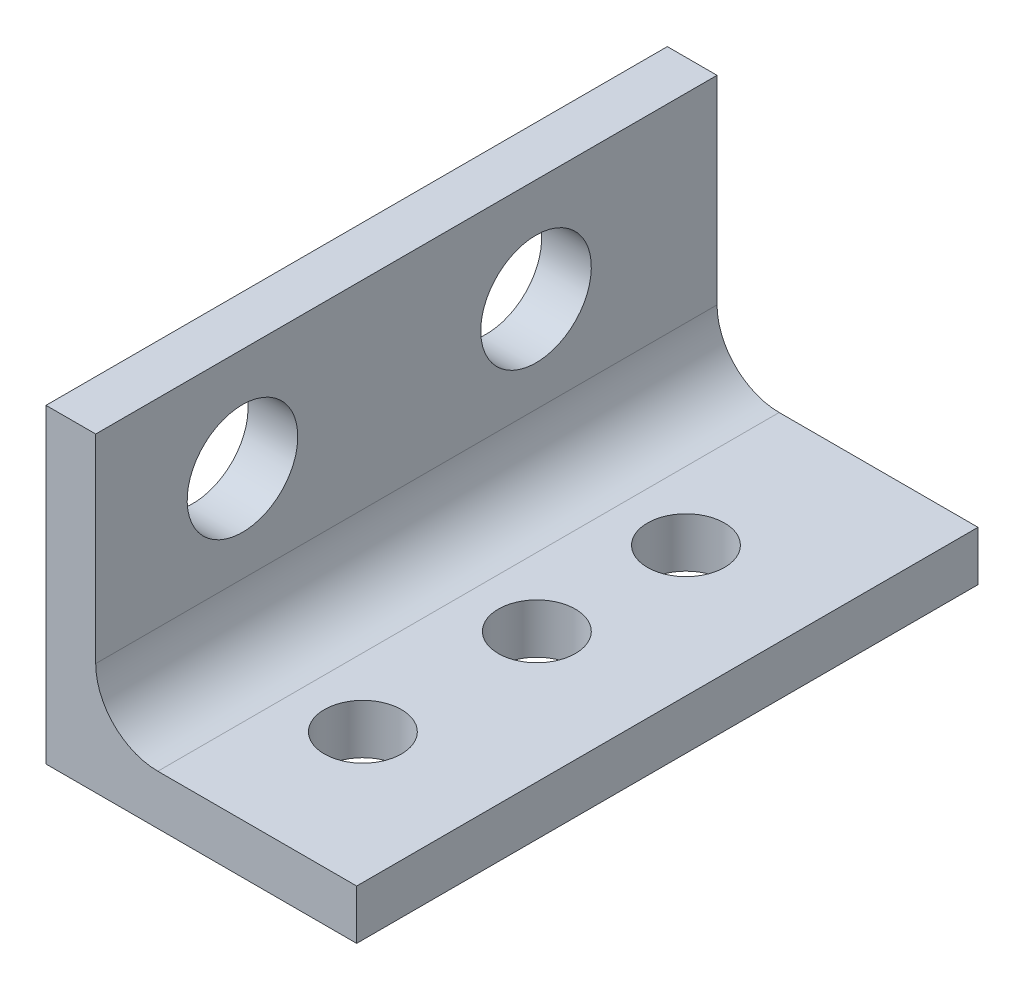
ISO-10303-21;
HEADER;
FILE_DESCRIPTION(('STEP AP214'),'2;1');
FILE_NAME('part.step','',(''),(''),'','','');
FILE_SCHEMA(('AUTOMOTIVE_DESIGN { 1 0 10303 214 1 1 1 1 }'));
ENDSEC;
DATA;
#1=APPLICATION_CONTEXT('core data for automotive mechanical design processes');
#2=APPLICATION_PROTOCOL_DEFINITION('international standard','automotive_design',2000,#1);
#3=PRODUCT_CONTEXT('',#1,'mechanical');
#4=PRODUCT('Part','Part','',(#3));
#5=PRODUCT_RELATED_PRODUCT_CATEGORY('part','',(#4));
#6=PRODUCT_DEFINITION_FORMATION('','',#4);
#7=PRODUCT_DEFINITION_CONTEXT('part definition',#1,'design');
#8=PRODUCT_DEFINITION('design','',#6,#7);
#9=PRODUCT_DEFINITION_SHAPE('','',#8);
#10=(LENGTH_UNIT() NAMED_UNIT(*) SI_UNIT(.MILLI.,.METRE.));
#11=(NAMED_UNIT(*) PLANE_ANGLE_UNIT() SI_UNIT($,.RADIAN.));
#12=(NAMED_UNIT(*) SI_UNIT($,.STERADIAN.) SOLID_ANGLE_UNIT());
#13=UNCERTAINTY_MEASURE_WITH_UNIT(LENGTH_MEASURE(1.E-05),#10,'distance_accuracy_value','');
#14=(GEOMETRIC_REPRESENTATION_CONTEXT(3) GLOBAL_UNCERTAINTY_ASSIGNED_CONTEXT((#13)) GLOBAL_UNIT_ASSIGNED_CONTEXT((#10,
#11,#12)) REPRESENTATION_CONTEXT('',''));
#15=CARTESIAN_POINT('',(0.,0.,0.));
#16=DIRECTION('',(0.,0.,1.));
#17=DIRECTION('',(1.,0.,0.));
#18=AXIS2_PLACEMENT_3D('',#15,#16,#17);
#19=CARTESIAN_POINT('',(-5.334,6.35,12.7));
#20=DIRECTION('',(0.,-1.,0.));
#21=DIRECTION('',(0.,0.,-1.));
#22=AXIS2_PLACEMENT_3D('',#19,#20,#21);
#23=PLANE('',#22);
#24=DIRECTION('',(-1.,0.,0.));
#25=VECTOR('',#24,1.);
#26=CARTESIAN_POINT('',(-5.334,6.35,0.));
#27=LINE('',#26,#25);
#28=CARTESIAN_POINT('',(-5.334,6.35,0.));
#29=VERTEX_POINT('',#28);
#30=CARTESIAN_POINT('',(-6.35,6.35,0.));
#31=VERTEX_POINT('',#30);
#32=EDGE_CURVE('E132',#29,#31,#27,.T.);
#33=ORIENTED_EDGE('',*,*,#32,.T.);
#34=DIRECTION('',(0.,0.,-1.));
#35=VECTOR('',#34,1.);
#36=CARTESIAN_POINT('',(-6.35,6.35,12.7));
#37=LINE('',#36,#35);
#38=CARTESIAN_POINT('',(-6.35,6.35,12.7));
#39=VERTEX_POINT('',#38);
#40=EDGE_CURVE('E113',#39,#31,#37,.T.);
#41=ORIENTED_EDGE('',*,*,#40,.F.);
#42=DIRECTION('',(-1.,0.,0.));
#43=VECTOR('',#42,1.);
#44=CARTESIAN_POINT('',(-5.334,6.35,12.7));
#45=LINE('',#44,#43);
#46=CARTESIAN_POINT('',(-5.334,6.35,12.7));
#47=VERTEX_POINT('',#46);
#48=EDGE_CURVE('E120',#47,#39,#45,.T.);
#49=ORIENTED_EDGE('',*,*,#48,.F.);
#50=DIRECTION('',(0.,0.,-1.));
#51=VECTOR('',#50,1.);
#52=CARTESIAN_POINT('',(-5.334,6.35,12.7));
#53=LINE('',#52,#51);
#54=EDGE_CURVE('E163',#47,#29,#53,.T.);
#55=ORIENTED_EDGE('',*,*,#54,.T.);
#56=EDGE_LOOP('',(#33,#41,#49,#55));
#57=FACE_BOUND('',#56,.T.);
#58=ADVANCED_FACE('F43',(#57),#23,.F.);
#59=CARTESIAN_POINT('',(-6.35,6.35,12.7));
#60=DIRECTION('',(1.,0.,0.));
#61=DIRECTION('',(0.,1.,0.));
#62=AXIS2_PLACEMENT_3D('',#59,#60,#61);
#63=PLANE('',#62);
#64=CARTESIAN_POINT('',(-6.35,4.24,3.7));
#65=DIRECTION('',(1.,0.,0.));
#66=DIRECTION('',(0.,1.,0.));
#67=AXIS2_PLACEMENT_3D('',#64,#65,#66);
#68=CIRCLE('',#67,1.1303);
#69=CARTESIAN_POINT('',(-6.35,5.3703,3.7));
#70=VERTEX_POINT('',#69);
#71=EDGE_CURVE('E208',#70,#70,#68,.F.);
#72=ORIENTED_EDGE('',*,*,#71,.F.);
#73=EDGE_LOOP('',(#72));
#74=FACE_BOUND('',#73,.T.);
#75=CARTESIAN_POINT('',(-6.35,4.24,9.7));
#76=DIRECTION('',(1.,0.,0.));
#77=DIRECTION('',(0.,1.,0.));
#78=AXIS2_PLACEMENT_3D('',#75,#76,#77);
#79=CIRCLE('',#78,1.1303);
#80=CARTESIAN_POINT('',(-6.35,5.3703,9.7));
#81=VERTEX_POINT('',#80);
#82=EDGE_CURVE('E202',#81,#81,#79,.F.);
#83=ORIENTED_EDGE('',*,*,#82,.F.);
#84=EDGE_LOOP('',(#83));
#85=FACE_BOUND('',#84,.T.);
#86=DIRECTION('',(0.,-1.,0.));
#87=VECTOR('',#86,1.);
#88=CARTESIAN_POINT('',(-6.35,6.35,0.));
#89=LINE('',#88,#87);
#90=CARTESIAN_POINT('',(-6.35,0.,0.));
#91=VERTEX_POINT('',#90);
#92=EDGE_CURVE('E151',#31,#91,#89,.T.);
#93=ORIENTED_EDGE('',*,*,#92,.T.);
#94=DIRECTION('',(0.,0.,-1.));
#95=VECTOR('',#94,1.);
#96=CARTESIAN_POINT('',(-6.35,0.,12.7));
#97=LINE('',#96,#95);
#98=CARTESIAN_POINT('',(-6.35,0.,12.7));
#99=VERTEX_POINT('',#98);
#100=EDGE_CURVE('E116',#99,#91,#97,.T.);
#101=ORIENTED_EDGE('',*,*,#100,.F.);
#102=DIRECTION('',(0.,-1.,0.));
#103=VECTOR('',#102,1.);
#104=CARTESIAN_POINT('',(-6.35,6.35,12.7));
#105=LINE('',#104,#103);
#106=EDGE_CURVE('E109',#39,#99,#105,.T.);
#107=ORIENTED_EDGE('',*,*,#106,.F.);
#108=ORIENTED_EDGE('',*,*,#40,.T.);
#109=EDGE_LOOP('',(#93,#101,#107,#108));
#110=FACE_BOUND('',#109,.T.);
#111=ADVANCED_FACE('F111',(#74,#85,#110),#63,.F.);
#112=CARTESIAN_POINT('',(-6.35,0.,12.7));
#113=DIRECTION('',(0.,1.,0.));
#114=DIRECTION('',(0.,0.,1.));
#115=AXIS2_PLACEMENT_3D('',#112,#113,#114);
#116=PLANE('',#115);
#117=CARTESIAN_POINT('',(-2.667,0.,3.302));
#118=DIRECTION('',(0.,1.,0.));
#119=DIRECTION('',(0.,0.,1.));
#120=AXIS2_PLACEMENT_3D('',#117,#118,#119);
#121=CIRCLE('',#120,0.787400000000001);
#122=CARTESIAN_POINT('',(-2.667,0.,4.0894));
#123=VERTEX_POINT('',#122);
#124=EDGE_CURVE('E194',#123,#123,#121,.T.);
#125=ORIENTED_EDGE('',*,*,#124,.T.);
#126=EDGE_LOOP('',(#125));
#127=FACE_BOUND('',#126,.T.);
#128=CARTESIAN_POINT('',(-2.667,0.,6.35));
#129=DIRECTION('',(0.,1.,0.));
#130=DIRECTION('',(0.,0.,1.));
#131=AXIS2_PLACEMENT_3D('',#128,#129,#130);
#132=CIRCLE('',#131,0.7874);
#133=CARTESIAN_POINT('',(-2.667,0.,7.1374));
#134=VERTEX_POINT('',#133);
#135=EDGE_CURVE('E186',#134,#134,#132,.T.);
#136=ORIENTED_EDGE('',*,*,#135,.T.);
#137=EDGE_LOOP('',(#136));
#138=FACE_BOUND('',#137,.T.);
#139=CARTESIAN_POINT('',(-2.667,0.,9.906));
#140=DIRECTION('',(0.,1.,0.));
#141=DIRECTION('',(0.,0.,1.));
#142=AXIS2_PLACEMENT_3D('',#139,#140,#141);
#143=CIRCLE('',#142,0.7874);
#144=CARTESIAN_POINT('',(-2.667,0.,10.6934));
#145=VERTEX_POINT('',#144);
#146=EDGE_CURVE('E161',#145,#145,#143,.T.);
#147=ORIENTED_EDGE('',*,*,#146,.T.);
#148=EDGE_LOOP('',(#147));
#149=FACE_BOUND('',#148,.T.);
#150=DIRECTION('',(1.,0.,0.));
#151=VECTOR('',#150,1.);
#152=CARTESIAN_POINT('',(-6.35,0.,0.));
#153=LINE('',#152,#151);
#154=CARTESIAN_POINT('',(0.,0.,0.));
#155=VERTEX_POINT('',#154);
#156=EDGE_CURVE('E153',#91,#155,#153,.T.);
#157=ORIENTED_EDGE('',*,*,#156,.T.);
#158=DIRECTION('',(0.,0.,-1.));
#159=VECTOR('',#158,1.);
#160=CARTESIAN_POINT('',(0.,0.,12.7));
#161=LINE('',#160,#159);
#162=CARTESIAN_POINT('',(0.,0.,12.7));
#163=VERTEX_POINT('',#162);
#164=EDGE_CURVE('E142',#163,#155,#161,.T.);
#165=ORIENTED_EDGE('',*,*,#164,.F.);
#166=DIRECTION('',(1.,0.,0.));
#167=VECTOR('',#166,1.);
#168=CARTESIAN_POINT('',(-6.35,0.,12.7));
#169=LINE('',#168,#167);
#170=EDGE_CURVE('E119',#99,#163,#169,.T.);
#171=ORIENTED_EDGE('',*,*,#170,.F.);
#172=ORIENTED_EDGE('',*,*,#100,.T.);
#173=EDGE_LOOP('',(#157,#165,#171,#172));
#174=FACE_BOUND('',#173,.T.);
#175=ADVANCED_FACE('F239',(#127,#138,#149,#174),#116,.F.);
#176=CARTESIAN_POINT('',(0.,1.016,12.7));
#177=DIRECTION('',(-1.,0.,0.));
#178=DIRECTION('',(0.,0.,1.));
#179=AXIS2_PLACEMENT_3D('',#176,#177,#178);
#180=PLANE('',#179);
#181=DIRECTION('',(0.,1.,0.));
#182=VECTOR('',#181,1.);
#183=CARTESIAN_POINT('',(0.,1.016,0.));
#184=LINE('',#183,#182);
#185=CARTESIAN_POINT('',(0.,1.016,0.));
#186=VERTEX_POINT('',#185);
#187=EDGE_CURVE('E156',#155,#186,#184,.T.);
#188=ORIENTED_EDGE('',*,*,#187,.T.);
#189=DIRECTION('',(0.,0.,-1.));
#190=VECTOR('',#189,1.);
#191=CARTESIAN_POINT('',(0.,1.016,12.7));
#192=LINE('',#191,#190);
#193=CARTESIAN_POINT('',(0.,1.016,12.7));
#194=VERTEX_POINT('',#193);
#195=EDGE_CURVE('E160',#194,#186,#192,.T.);
#196=ORIENTED_EDGE('',*,*,#195,.F.);
#197=DIRECTION('',(0.,1.,0.));
#198=VECTOR('',#197,1.);
#199=CARTESIAN_POINT('',(0.,1.016,12.7));
#200=LINE('',#199,#198);
#201=EDGE_CURVE('E177',#163,#194,#200,.T.);
#202=ORIENTED_EDGE('',*,*,#201,.F.);
#203=ORIENTED_EDGE('',*,*,#164,.T.);
#204=EDGE_LOOP('',(#188,#196,#202,#203));
#205=FACE_BOUND('',#204,.T.);
#206=ADVANCED_FACE('F236',(#205),#180,.F.);
#207=CARTESIAN_POINT('',(-5.334,1.016,12.7));
#208=DIRECTION('',(0.,-1.,0.));
#209=DIRECTION('',(0.,0.,-1.));
#210=AXIS2_PLACEMENT_3D('',#207,#208,#209);
#211=PLANE('',#210);
#212=CARTESIAN_POINT('',(-2.667,1.016,3.302));
#213=DIRECTION('',(0.,1.,0.));
#214=DIRECTION('',(0.,0.,1.));
#215=AXIS2_PLACEMENT_3D('',#212,#213,#214);
#216=CIRCLE('',#215,0.787400000000001);
#217=CARTESIAN_POINT('',(-2.667,1.016,4.0894));
#218=VERTEX_POINT('',#217);
#219=EDGE_CURVE('E198',#218,#218,#216,.T.);
#220=ORIENTED_EDGE('',*,*,#219,.F.);
#221=EDGE_LOOP('',(#220));
#222=FACE_BOUND('',#221,.T.);
#223=CARTESIAN_POINT('',(-2.667,1.016,6.35));
#224=DIRECTION('',(0.,1.,0.));
#225=DIRECTION('',(0.,0.,1.));
#226=AXIS2_PLACEMENT_3D('',#223,#224,#225);
#227=CIRCLE('',#226,0.7874);
#228=CARTESIAN_POINT('',(-2.667,1.016,7.1374));
#229=VERTEX_POINT('',#228);
#230=EDGE_CURVE('E190',#229,#229,#227,.T.);
#231=ORIENTED_EDGE('',*,*,#230,.F.);
#232=EDGE_LOOP('',(#231));
#233=FACE_BOUND('',#232,.T.);
#234=CARTESIAN_POINT('',(-2.667,1.016,9.906));
#235=DIRECTION('',(0.,1.,0.));
#236=DIRECTION('',(0.,0.,1.));
#237=AXIS2_PLACEMENT_3D('',#234,#235,#236);
#238=CIRCLE('',#237,0.7874);
#239=CARTESIAN_POINT('',(-2.667,1.016,10.6934));
#240=VERTEX_POINT('',#239);
#241=EDGE_CURVE('E183',#240,#240,#238,.T.);
#242=ORIENTED_EDGE('',*,*,#241,.F.);
#243=EDGE_LOOP('',(#242));
#244=FACE_BOUND('',#243,.T.);
#245=DIRECTION('',(-1.,0.,0.));
#246=VECTOR('',#245,1.);
#247=CARTESIAN_POINT('',(-5.334,1.016,0.));
#248=LINE('',#247,#246);
#249=CARTESIAN_POINT('',(-4.064,1.016,0.));
#250=VERTEX_POINT('',#249);
#251=EDGE_CURVE('E172',#186,#250,#248,.T.);
#252=ORIENTED_EDGE('',*,*,#251,.T.);
#253=DIRECTION('',(0.,0.,-1.));
#254=VECTOR('',#253,1.);
#255=CARTESIAN_POINT('',(-4.064,1.016,12.7));
#256=LINE('',#255,#254);
#257=CARTESIAN_POINT('',(-4.064,1.016,12.7));
#258=VERTEX_POINT('',#257);
#259=EDGE_CURVE('E58',#250,#258,#256,.F.);
#260=ORIENTED_EDGE('',*,*,#259,.T.);
#261=DIRECTION('',(-1.,0.,0.));
#262=VECTOR('',#261,1.);
#263=CARTESIAN_POINT('',(-5.334,1.016,12.7));
#264=LINE('',#263,#262);
#265=EDGE_CURVE('E168',#194,#258,#264,.T.);
#266=ORIENTED_EDGE('',*,*,#265,.F.);
#267=ORIENTED_EDGE('',*,*,#195,.T.);
#268=EDGE_LOOP('',(#252,#260,#266,#267));
#269=FACE_BOUND('',#268,.T.);
#270=ADVANCED_FACE('F223',(#222,#233,#244,#269),#211,.F.);
#271=CARTESIAN_POINT('',(-5.334,6.35,12.7));
#272=DIRECTION('',(-1.,0.,0.));
#273=DIRECTION('',(0.,-1.,0.));
#274=AXIS2_PLACEMENT_3D('',#271,#272,#273);
#275=PLANE('',#274);
#276=CARTESIAN_POINT('',(-5.334,4.24,3.7));
#277=DIRECTION('',(1.,0.,0.));
#278=DIRECTION('',(0.,1.,0.));
#279=AXIS2_PLACEMENT_3D('',#276,#277,#278);
#280=CIRCLE('',#279,1.1303);
#281=CARTESIAN_POINT('',(-5.334,5.3703,3.7));
#282=VERTEX_POINT('',#281);
#283=EDGE_CURVE('E212',#282,#282,#280,.T.);
#284=ORIENTED_EDGE('',*,*,#283,.F.);
#285=EDGE_LOOP('',(#284));
#286=FACE_BOUND('',#285,.T.);
#287=CARTESIAN_POINT('',(-5.334,4.24,9.7));
#288=DIRECTION('',(1.,0.,0.));
#289=DIRECTION('',(0.,1.,0.));
#290=AXIS2_PLACEMENT_3D('',#287,#288,#289);
#291=CIRCLE('',#290,1.1303);
#292=CARTESIAN_POINT('',(-5.334,5.3703,9.7));
#293=VERTEX_POINT('',#292);
#294=EDGE_CURVE('E205',#293,#293,#291,.T.);
#295=ORIENTED_EDGE('',*,*,#294,.F.);
#296=EDGE_LOOP('',(#295));
#297=FACE_BOUND('',#296,.T.);
#298=DIRECTION('',(0.,1.,0.));
#299=VECTOR('',#298,1.);
#300=CARTESIAN_POINT('',(-5.334,6.35,12.7));
#301=LINE('',#300,#299);
#302=CARTESIAN_POINT('',(-5.334,2.286,12.7));
#303=VERTEX_POINT('',#302);
#304=EDGE_CURVE('E125',#303,#47,#301,.T.);
#305=ORIENTED_EDGE('',*,*,#304,.F.);
#306=DIRECTION('',(0.,0.,-1.));
#307=VECTOR('',#306,1.);
#308=CARTESIAN_POINT('',(-5.334,2.286,0.));
#309=LINE('',#308,#307);
#310=CARTESIAN_POINT('',(-5.334,2.286,0.));
#311=VERTEX_POINT('',#310);
#312=EDGE_CURVE('E134',#303,#311,#309,.T.);
#313=ORIENTED_EDGE('',*,*,#312,.T.);
#314=DIRECTION('',(0.,1.,0.));
#315=VECTOR('',#314,1.);
#316=CARTESIAN_POINT('',(-5.334,6.35,0.));
#317=LINE('',#316,#315);
#318=EDGE_CURVE('E129',#311,#29,#317,.T.);
#319=ORIENTED_EDGE('',*,*,#318,.T.);
#320=ORIENTED_EDGE('',*,*,#54,.F.);
#321=EDGE_LOOP('',(#305,#313,#319,#320));
#322=FACE_BOUND('',#321,.T.);
#323=ADVANCED_FACE('F220',(#286,#297,#322),#275,.F.);
#324=CARTESIAN_POINT('',(0.,0.,12.7));
#325=DIRECTION('',(0.,0.,1.));
#326=DIRECTION('',(1.,0.,0.));
#327=AXIS2_PLACEMENT_3D('',#324,#325,#326);
#328=PLANE('',#327);
#329=ORIENTED_EDGE('',*,*,#48,.T.);
#330=ORIENTED_EDGE('',*,*,#106,.T.);
#331=ORIENTED_EDGE('',*,*,#170,.T.);
#332=ORIENTED_EDGE('',*,*,#201,.T.);
#333=ORIENTED_EDGE('',*,*,#265,.T.);
#334=CARTESIAN_POINT('',(-4.064,2.286,12.7));
#335=DIRECTION('',(0.,0.,1.));
#336=DIRECTION('',(1.,0.,0.));
#337=AXIS2_PLACEMENT_3D('',#334,#335,#336);
#338=CIRCLE('',#337,1.27);
#339=EDGE_CURVE('E11',#258,#303,#338,.F.);
#340=ORIENTED_EDGE('',*,*,#339,.T.);
#341=ORIENTED_EDGE('',*,*,#304,.T.);
#342=EDGE_LOOP('',(#329,#330,#331,#332,#333,#340,#341));
#343=FACE_BOUND('',#342,.T.);
#344=ADVANCED_FACE('F123',(#343),#328,.T.);
#345=CARTESIAN_POINT('',(0.,0.,0.));
#346=DIRECTION('',(0.,0.,1.));
#347=DIRECTION('',(1.,0.,0.));
#348=AXIS2_PLACEMENT_3D('',#345,#346,#347);
#349=PLANE('',#348);
#350=ORIENTED_EDGE('',*,*,#32,.F.);
#351=ORIENTED_EDGE('',*,*,#318,.F.);
#352=CARTESIAN_POINT('',(-4.064,2.286,0.));
#353=DIRECTION('',(0.,0.,1.));
#354=DIRECTION('',(1.,0.,0.));
#355=AXIS2_PLACEMENT_3D('',#352,#353,#354);
#356=CIRCLE('',#355,1.27);
#357=EDGE_CURVE('E51',#311,#250,#356,.T.);
#358=ORIENTED_EDGE('',*,*,#357,.T.);
#359=ORIENTED_EDGE('',*,*,#251,.F.);
#360=ORIENTED_EDGE('',*,*,#187,.F.);
#361=ORIENTED_EDGE('',*,*,#156,.F.);
#362=ORIENTED_EDGE('',*,*,#92,.F.);
#363=EDGE_LOOP('',(#350,#351,#358,#359,#360,#361,#362));
#364=FACE_BOUND('',#363,.T.);
#365=ADVANCED_FACE('F234',(#364),#349,.F.);
#366=CARTESIAN_POINT('',(-2.667,-1.524,9.906));
#367=DIRECTION('',(0.,1.,0.));
#368=DIRECTION('',(0.,0.,1.));
#369=AXIS2_PLACEMENT_3D('',#366,#367,#368);
#370=CYLINDRICAL_SURFACE('',#369,0.7874);
#371=ORIENTED_EDGE('',*,*,#241,.T.);
#372=EDGE_LOOP('',(#371));
#373=FACE_BOUND('',#372,.T.);
#374=ORIENTED_EDGE('',*,*,#146,.F.);
#375=EDGE_LOOP('',(#374));
#376=FACE_BOUND('',#375,.T.);
#377=ADVANCED_FACE('F318',(#373,#376),#370,.F.);
#378=CARTESIAN_POINT('',(-2.667,-1.524,6.35));
#379=DIRECTION('',(0.,1.,0.));
#380=DIRECTION('',(0.,0.,1.));
#381=AXIS2_PLACEMENT_3D('',#378,#379,#380);
#382=CYLINDRICAL_SURFACE('',#381,0.7874);
#383=ORIENTED_EDGE('',*,*,#230,.T.);
#384=EDGE_LOOP('',(#383));
#385=FACE_BOUND('',#384,.T.);
#386=ORIENTED_EDGE('',*,*,#135,.F.);
#387=EDGE_LOOP('',(#386));
#388=FACE_BOUND('',#387,.T.);
#389=ADVANCED_FACE('F309',(#385,#388),#382,.F.);
#390=CARTESIAN_POINT('',(-2.667,-1.524,3.302));
#391=DIRECTION('',(0.,1.,0.));
#392=DIRECTION('',(0.,0.,1.));
#393=AXIS2_PLACEMENT_3D('',#390,#391,#392);
#394=CYLINDRICAL_SURFACE('',#393,0.787400000000001);
#395=ORIENTED_EDGE('',*,*,#219,.T.);
#396=EDGE_LOOP('',(#395));
#397=FACE_BOUND('',#396,.T.);
#398=ORIENTED_EDGE('',*,*,#124,.F.);
#399=EDGE_LOOP('',(#398));
#400=FACE_BOUND('',#399,.T.);
#401=ADVANCED_FACE('F278',(#397,#400),#394,.F.);
#402=CARTESIAN_POINT('',(-4.064,2.286,12.7));
#403=DIRECTION('',(0.,0.,1.));
#404=DIRECTION('',(1.,0.,0.));
#405=AXIS2_PLACEMENT_3D('',#402,#403,#404);
#406=CYLINDRICAL_SURFACE('',#405,1.27);
#407=ORIENTED_EDGE('',*,*,#339,.F.);
#408=ORIENTED_EDGE('',*,*,#259,.F.);
#409=ORIENTED_EDGE('',*,*,#357,.F.);
#410=ORIENTED_EDGE('',*,*,#312,.F.);
#411=EDGE_LOOP('',(#407,#408,#409,#410));
#412=FACE_BOUND('',#411,.T.);
#413=ADVANCED_FACE('F45',(#412),#406,.F.);
#414=CARTESIAN_POINT('',(-6.351,4.24,9.7));
#415=DIRECTION('',(1.,0.,0.));
#416=DIRECTION('',(0.,1.,0.));
#417=AXIS2_PLACEMENT_3D('',#414,#415,#416);
#418=CYLINDRICAL_SURFACE('',#417,1.1303);
#419=ORIENTED_EDGE('',*,*,#294,.T.);
#420=EDGE_LOOP('',(#419));
#421=FACE_BOUND('',#420,.T.);
#422=ORIENTED_EDGE('',*,*,#82,.T.);
#423=EDGE_LOOP('',(#422));
#424=FACE_BOUND('',#423,.T.);
#425=ADVANCED_FACE('F277',(#421,#424),#418,.F.);
#426=CARTESIAN_POINT('',(-6.351,4.24,3.7));
#427=DIRECTION('',(1.,0.,0.));
#428=DIRECTION('',(0.,1.,0.));
#429=AXIS2_PLACEMENT_3D('',#426,#427,#428);
#430=CYLINDRICAL_SURFACE('',#429,1.1303);
#431=ORIENTED_EDGE('',*,*,#283,.T.);
#432=EDGE_LOOP('',(#431));
#433=FACE_BOUND('',#432,.T.);
#434=ORIENTED_EDGE('',*,*,#71,.T.);
#435=EDGE_LOOP('',(#434));
#436=FACE_BOUND('',#435,.T.);
#437=ADVANCED_FACE('F217',(#433,#436),#430,.F.);
#438=CLOSED_SHELL('',(#58,#111,#175,#206,#270,#323,#344,#365,#377,#389,#401,#413,#425,#437));
#439=MANIFOLD_SOLID_BREP('B2',#438);
#440=ADVANCED_BREP_SHAPE_REPRESENTATION('',(#18,#439),#14);
#441=SHAPE_DEFINITION_REPRESENTATION(#9,#440);
ENDSEC;
END-ISO-10303-21;
